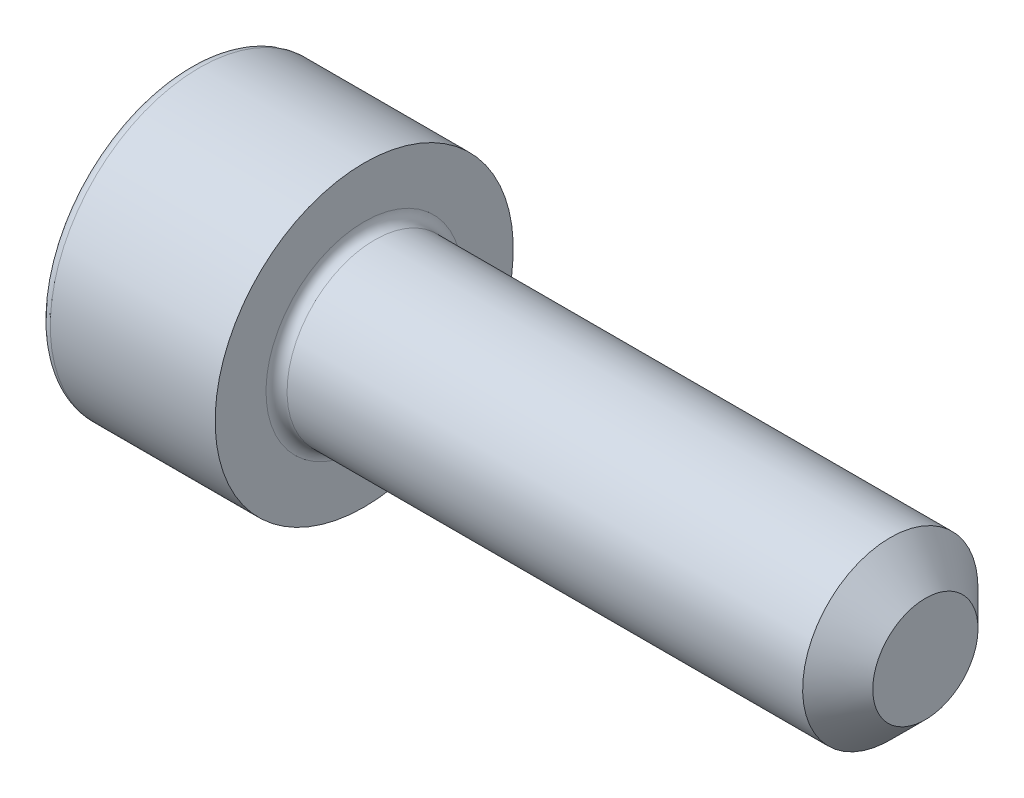
ISO-10303-21;
HEADER;
FILE_DESCRIPTION(('STEP AP214'),'2;1');
FILE_NAME('part.step','',(''),(''),'','','');
FILE_SCHEMA(('AUTOMOTIVE_DESIGN { 1 0 10303 214 1 1 1 1 }'));
ENDSEC;
DATA;
#1=APPLICATION_CONTEXT('core data for automotive mechanical design processes');
#2=APPLICATION_PROTOCOL_DEFINITION('international standard','automotive_design',2000,#1);
#3=PRODUCT_CONTEXT('',#1,'mechanical');
#4=PRODUCT('Part','Part','',(#3));
#5=PRODUCT_RELATED_PRODUCT_CATEGORY('part','',(#4));
#6=PRODUCT_DEFINITION_FORMATION('','',#4);
#7=PRODUCT_DEFINITION_CONTEXT('part definition',#1,'design');
#8=PRODUCT_DEFINITION('design','',#6,#7);
#9=PRODUCT_DEFINITION_SHAPE('','',#8);
#10=(LENGTH_UNIT() NAMED_UNIT(*) SI_UNIT(.MILLI.,.METRE.));
#11=(NAMED_UNIT(*) PLANE_ANGLE_UNIT() SI_UNIT($,.RADIAN.));
#12=(NAMED_UNIT(*) SI_UNIT($,.STERADIAN.) SOLID_ANGLE_UNIT());
#13=UNCERTAINTY_MEASURE_WITH_UNIT(LENGTH_MEASURE(1.E-05),#10,'distance_accuracy_value','');
#14=(GEOMETRIC_REPRESENTATION_CONTEXT(3) GLOBAL_UNCERTAINTY_ASSIGNED_CONTEXT((#13)) GLOBAL_UNIT_ASSIGNED_CONTEXT((#10,
#11,#12)) REPRESENTATION_CONTEXT('',''));
#15=CARTESIAN_POINT('',(0.,0.,0.));
#16=DIRECTION('',(0.,0.,1.));
#17=DIRECTION('',(1.,0.,0.));
#18=AXIS2_PLACEMENT_3D('',#15,#16,#17);
#19=CARTESIAN_POINT('',(0.,0.,0.));
#20=DIRECTION('',(-1.,0.,0.));
#21=DIRECTION('',(0.,-1.,0.));
#22=AXIS2_PLACEMENT_3D('',#19,#20,#21);
#23=PLANE('',#22);
#24=CARTESIAN_POINT('',(0.,0.,0.));
#25=DIRECTION('',(-1.,0.,0.));
#26=DIRECTION('',(0.,-1.,0.));
#27=AXIS2_PLACEMENT_3D('',#24,#25,#26);
#28=CIRCLE('',#27,3.95);
#29=CARTESIAN_POINT('',(0.,-3.95,0.));
#30=VERTEX_POINT('',#29);
#31=EDGE_CURVE('E158',#30,#30,#28,.T.);
#32=ORIENTED_EDGE('',*,*,#31,.T.);
#33=EDGE_LOOP('',(#32));
#34=FACE_BOUND('',#33,.T.);
#35=DIRECTION('',(0.,0.,-1.));
#36=VECTOR('',#35,1.);
#37=CARTESIAN_POINT('',(0.,2.,1.15470053837925));
#38=LINE('',#37,#36);
#39=CARTESIAN_POINT('',(0.,2.,1.15470053837925));
#40=VERTEX_POINT('',#39);
#41=CARTESIAN_POINT('',(0.,2.,-1.15470053837925));
#42=VERTEX_POINT('',#41);
#43=EDGE_CURVE('E54',#40,#42,#38,.T.);
#44=ORIENTED_EDGE('',*,*,#43,.F.);
#45=DIRECTION('',(0.,0.866025403784439,-0.5));
#46=VECTOR('',#45,1.);
#47=CARTESIAN_POINT('',(0.,0.,2.3094010767585));
#48=LINE('',#47,#46);
#49=CARTESIAN_POINT('',(0.,0.,2.3094010767585));
#50=VERTEX_POINT('',#49);
#51=EDGE_CURVE('E137',#50,#40,#48,.T.);
#52=ORIENTED_EDGE('',*,*,#51,.F.);
#53=DIRECTION('',(0.,0.866025403784438,0.5));
#54=VECTOR('',#53,1.);
#55=CARTESIAN_POINT('',(0.,-2.,1.15470053837925));
#56=LINE('',#55,#54);
#57=CARTESIAN_POINT('',(0.,-2.,1.15470053837925));
#58=VERTEX_POINT('',#57);
#59=EDGE_CURVE('E135',#58,#50,#56,.T.);
#60=ORIENTED_EDGE('',*,*,#59,.F.);
#61=DIRECTION('',(0.,0.,1.));
#62=VECTOR('',#61,1.);
#63=CARTESIAN_POINT('',(0.,-2.,-1.15470053837925));
#64=LINE('',#63,#62);
#65=CARTESIAN_POINT('',(0.,-2.,-1.15470053837925));
#66=VERTEX_POINT('',#65);
#67=EDGE_CURVE('E102',#66,#58,#64,.T.);
#68=ORIENTED_EDGE('',*,*,#67,.F.);
#69=DIRECTION('',(0.,-0.866025403784439,0.5));
#70=VECTOR('',#69,1.);
#71=CARTESIAN_POINT('',(0.,0.,-2.3094010767585));
#72=LINE('',#71,#70);
#73=CARTESIAN_POINT('',(0.,0.,-2.3094010767585));
#74=VERTEX_POINT('',#73);
#75=EDGE_CURVE('E131',#74,#66,#72,.T.);
#76=ORIENTED_EDGE('',*,*,#75,.F.);
#77=DIRECTION('',(0.,-0.866025403784439,-0.5));
#78=VECTOR('',#77,1.);
#79=CARTESIAN_POINT('',(0.,2.,-1.15470053837925));
#80=LINE('',#79,#78);
#81=EDGE_CURVE('E128',#42,#74,#80,.T.);
#82=ORIENTED_EDGE('',*,*,#81,.F.);
#83=EDGE_LOOP('',(#44,#52,#60,#68,#76,#82));
#84=FACE_BOUND('',#83,.T.);
#85=ADVANCED_FACE('F38',(#34,#84),#23,.T.);
#86=CARTESIAN_POINT('',(21.,0.,0.));
#87=DIRECTION('',(1.,0.,0.));
#88=DIRECTION('',(0.,1.,0.));
#89=AXIS2_PLACEMENT_3D('',#86,#87,#88);
#90=CYLINDRICAL_SURFACE('',#89,4.25);
#91=CARTESIAN_POINT('',(0.300000000000002,0.,0.));
#92=DIRECTION('',(-1.,0.,0.));
#93=DIRECTION('',(0.,-1.,0.));
#94=AXIS2_PLACEMENT_3D('',#91,#92,#93);
#95=CIRCLE('',#94,4.25);
#96=CARTESIAN_POINT('',(0.300000000000002,-4.25,0.));
#97=VERTEX_POINT('',#96);
#98=EDGE_CURVE('E155',#97,#97,#95,.F.);
#99=ORIENTED_EDGE('',*,*,#98,.T.);
#100=EDGE_LOOP('',(#99));
#101=FACE_BOUND('',#100,.T.);
#102=CARTESIAN_POINT('',(5.,0.,0.));
#103=DIRECTION('',(1.,0.,0.));
#104=DIRECTION('',(0.,1.,0.));
#105=AXIS2_PLACEMENT_3D('',#102,#103,#104);
#106=CIRCLE('',#105,4.25);
#107=CARTESIAN_POINT('',(5.,4.25,0.));
#108=VERTEX_POINT('',#107);
#109=EDGE_CURVE('E141',#108,#108,#106,.T.);
#110=ORIENTED_EDGE('',*,*,#109,.F.);
#111=EDGE_LOOP('',(#110));
#112=FACE_BOUND('',#111,.T.);
#113=ADVANCED_FACE('F175',(#101,#112),#90,.T.);
#114=CARTESIAN_POINT('',(5.,4.25,0.));
#115=DIRECTION('',(1.,0.,0.));
#116=DIRECTION('',(0.,1.,0.));
#117=AXIS2_PLACEMENT_3D('',#114,#115,#116);
#118=PLANE('',#117);
#119=CARTESIAN_POINT('',(5.,0.,0.));
#120=DIRECTION('',(1.,0.,0.));
#121=DIRECTION('',(0.,1.,0.));
#122=AXIS2_PLACEMENT_3D('',#119,#120,#121);
#123=CIRCLE('',#122,2.8);
#124=CARTESIAN_POINT('',(5.,2.8,0.));
#125=VERTEX_POINT('',#124);
#126=EDGE_CURVE('E152',#125,#125,#123,.F.);
#127=ORIENTED_EDGE('',*,*,#126,.T.);
#128=EDGE_LOOP('',(#127));
#129=FACE_BOUND('',#128,.T.);
#130=ORIENTED_EDGE('',*,*,#109,.T.);
#131=EDGE_LOOP('',(#130));
#132=FACE_BOUND('',#131,.T.);
#133=ADVANCED_FACE('F181',(#129,#132),#118,.T.);
#134=CARTESIAN_POINT('',(21.,0.,0.));
#135=DIRECTION('',(1.,0.,0.));
#136=DIRECTION('',(0.,1.,0.));
#137=AXIS2_PLACEMENT_3D('',#134,#135,#136);
#138=CYLINDRICAL_SURFACE('',#137,2.5);
#139=CARTESIAN_POINT('',(20.,0.,0.));
#140=DIRECTION('',(1.,0.,0.));
#141=DIRECTION('',(0.,1.,0.));
#142=AXIS2_PLACEMENT_3D('',#139,#140,#141);
#143=CIRCLE('',#142,2.5);
#144=CARTESIAN_POINT('',(20.,2.5,0.));
#145=VERTEX_POINT('',#144);
#146=EDGE_CURVE('E11',#145,#145,#143,.F.);
#147=ORIENTED_EDGE('',*,*,#146,.T.);
#148=EDGE_LOOP('',(#147));
#149=FACE_BOUND('',#148,.T.);
#150=CARTESIAN_POINT('',(5.3,0.,0.));
#151=DIRECTION('',(1.,0.,0.));
#152=DIRECTION('',(0.,1.,0.));
#153=AXIS2_PLACEMENT_3D('',#150,#151,#152);
#154=CIRCLE('',#153,2.5);
#155=CARTESIAN_POINT('',(5.3,2.5,0.));
#156=VERTEX_POINT('',#155);
#157=EDGE_CURVE('E149',#156,#156,#154,.T.);
#158=ORIENTED_EDGE('',*,*,#157,.T.);
#159=EDGE_LOOP('',(#158));
#160=FACE_BOUND('',#159,.T.);
#161=ADVANCED_FACE('F198',(#149,#160),#138,.T.);
#162=CARTESIAN_POINT('',(21.,2.5,0.));
#163=DIRECTION('',(1.,0.,0.));
#164=DIRECTION('',(0.,1.,0.));
#165=AXIS2_PLACEMENT_3D('',#162,#163,#164);
#166=PLANE('',#165);
#167=CARTESIAN_POINT('',(21.,0.,0.));
#168=DIRECTION('',(1.,0.,0.));
#169=DIRECTION('',(0.,1.,0.));
#170=AXIS2_PLACEMENT_3D('',#167,#168,#169);
#171=CIRCLE('',#170,1.5);
#172=CARTESIAN_POINT('',(21.,1.5,0.));
#173=VERTEX_POINT('',#172);
#174=EDGE_CURVE('E47',#173,#173,#171,.T.);
#175=ORIENTED_EDGE('',*,*,#174,.T.);
#176=EDGE_LOOP('',(#175));
#177=FACE_BOUND('',#176,.T.);
#178=ADVANCED_FACE('F163',(#177),#166,.T.);
#179=CARTESIAN_POINT('',(2.5,2.,1.15470053837925));
#180=DIRECTION('',(0.,1.,0.));
#181=DIRECTION('',(-1.,0.,0.));
#182=AXIS2_PLACEMENT_3D('',#179,#180,#181);
#183=PLANE('',#182);
#184=ORIENTED_EDGE('',*,*,#43,.T.);
#185=DIRECTION('',(-1.,0.,0.));
#186=VECTOR('',#185,1.);
#187=CARTESIAN_POINT('',(2.5,2.,-1.15470053837925));
#188=LINE('',#187,#186);
#189=CARTESIAN_POINT('',(2.5,2.,-1.15470053837925));
#190=VERTEX_POINT('',#189);
#191=EDGE_CURVE('E84',#190,#42,#188,.T.);
#192=ORIENTED_EDGE('',*,*,#191,.F.);
#193=DIRECTION('',(0.,0.,-1.));
#194=VECTOR('',#193,1.);
#195=CARTESIAN_POINT('',(2.5,2.,1.15470053837925));
#196=LINE('',#195,#194);
#197=CARTESIAN_POINT('',(2.5,2.,1.15470053837925));
#198=VERTEX_POINT('',#197);
#199=EDGE_CURVE('E139',#198,#190,#196,.T.);
#200=ORIENTED_EDGE('',*,*,#199,.F.);
#201=DIRECTION('',(-1.,0.,0.));
#202=VECTOR('',#201,1.);
#203=CARTESIAN_POINT('',(2.5,2.,1.15470053837925));
#204=LINE('',#203,#202);
#205=EDGE_CURVE('E62',#198,#40,#204,.T.);
#206=ORIENTED_EDGE('',*,*,#205,.T.);
#207=EDGE_LOOP('',(#184,#192,#200,#206));
#208=FACE_BOUND('',#207,.T.);
#209=ADVANCED_FACE('F206',(#208),#183,.F.);
#210=CARTESIAN_POINT('',(2.5,0.,2.3094010767585));
#211=DIRECTION('',(0.,0.5,0.866025403784439));
#212=DIRECTION('',(0.,-0.866025403784439,0.5));
#213=AXIS2_PLACEMENT_3D('',#210,#211,#212);
#214=PLANE('',#213);
#215=ORIENTED_EDGE('',*,*,#51,.T.);
#216=ORIENTED_EDGE('',*,*,#205,.F.);
#217=DIRECTION('',(0.,0.866025403784439,-0.5));
#218=VECTOR('',#217,1.);
#219=CARTESIAN_POINT('',(2.5,0.,2.3094010767585));
#220=LINE('',#219,#218);
#221=CARTESIAN_POINT('',(2.5,0.,2.3094010767585));
#222=VERTEX_POINT('',#221);
#223=EDGE_CURVE('E114',#222,#198,#220,.T.);
#224=ORIENTED_EDGE('',*,*,#223,.F.);
#225=DIRECTION('',(-1.,0.,0.));
#226=VECTOR('',#225,1.);
#227=CARTESIAN_POINT('',(2.5,0.,2.3094010767585));
#228=LINE('',#227,#226);
#229=EDGE_CURVE('E106',#222,#50,#228,.T.);
#230=ORIENTED_EDGE('',*,*,#229,.T.);
#231=EDGE_LOOP('',(#215,#216,#224,#230));
#232=FACE_BOUND('',#231,.T.);
#233=ADVANCED_FACE('F212',(#232),#214,.F.);
#234=CARTESIAN_POINT('',(2.5,-2.,1.15470053837925));
#235=DIRECTION('',(0.,-0.5,0.866025403784438));
#236=DIRECTION('',(0.,-0.866025403784439,-0.5));
#237=AXIS2_PLACEMENT_3D('',#234,#235,#236);
#238=PLANE('',#237);
#239=ORIENTED_EDGE('',*,*,#59,.T.);
#240=ORIENTED_EDGE('',*,*,#229,.F.);
#241=DIRECTION('',(0.,0.866025403784438,0.5));
#242=VECTOR('',#241,1.);
#243=CARTESIAN_POINT('',(2.5,-2.,1.15470053837925));
#244=LINE('',#243,#242);
#245=CARTESIAN_POINT('',(2.5,-2.,1.15470053837925));
#246=VERTEX_POINT('',#245);
#247=EDGE_CURVE('E110',#246,#222,#244,.T.);
#248=ORIENTED_EDGE('',*,*,#247,.F.);
#249=DIRECTION('',(-1.,0.,0.));
#250=VECTOR('',#249,1.);
#251=CARTESIAN_POINT('',(2.5,-2.,1.15470053837925));
#252=LINE('',#251,#250);
#253=EDGE_CURVE('E95',#246,#58,#252,.T.);
#254=ORIENTED_EDGE('',*,*,#253,.T.);
#255=EDGE_LOOP('',(#239,#240,#248,#254));
#256=FACE_BOUND('',#255,.T.);
#257=ADVANCED_FACE('F111',(#256),#238,.F.);
#258=CARTESIAN_POINT('',(2.5,-2.,-1.15470053837925));
#259=DIRECTION('',(0.,-1.,0.));
#260=DIRECTION('',(0.,0.,-1.));
#261=AXIS2_PLACEMENT_3D('',#258,#259,#260);
#262=PLANE('',#261);
#263=ORIENTED_EDGE('',*,*,#67,.T.);
#264=ORIENTED_EDGE('',*,*,#253,.F.);
#265=DIRECTION('',(0.,0.,1.));
#266=VECTOR('',#265,1.);
#267=CARTESIAN_POINT('',(2.5,-2.,-1.15470053837925));
#268=LINE('',#267,#266);
#269=CARTESIAN_POINT('',(2.5,-2.,-1.15470053837925));
#270=VERTEX_POINT('',#269);
#271=EDGE_CURVE('E99',#270,#246,#268,.T.);
#272=ORIENTED_EDGE('',*,*,#271,.F.);
#273=DIRECTION('',(-1.,0.,0.));
#274=VECTOR('',#273,1.);
#275=CARTESIAN_POINT('',(2.5,-2.,-1.15470053837925));
#276=LINE('',#275,#274);
#277=EDGE_CURVE('E107',#270,#66,#276,.T.);
#278=ORIENTED_EDGE('',*,*,#277,.T.);
#279=EDGE_LOOP('',(#263,#264,#272,#278));
#280=FACE_BOUND('',#279,.T.);
#281=ADVANCED_FACE('F97',(#280),#262,.F.);
#282=CARTESIAN_POINT('',(2.5,0.,-2.3094010767585));
#283=DIRECTION('',(0.,-0.5,-0.866025403784439));
#284=DIRECTION('',(0.,0.866025403784439,-0.5));
#285=AXIS2_PLACEMENT_3D('',#282,#283,#284);
#286=PLANE('',#285);
#287=ORIENTED_EDGE('',*,*,#75,.T.);
#288=ORIENTED_EDGE('',*,*,#277,.F.);
#289=DIRECTION('',(0.,-0.866025403784439,0.5));
#290=VECTOR('',#289,1.);
#291=CARTESIAN_POINT('',(2.5,0.,-2.3094010767585));
#292=LINE('',#291,#290);
#293=CARTESIAN_POINT('',(2.5,0.,-2.3094010767585));
#294=VERTEX_POINT('',#293);
#295=EDGE_CURVE('E120',#294,#270,#292,.T.);
#296=ORIENTED_EDGE('',*,*,#295,.F.);
#297=DIRECTION('',(-1.,0.,0.));
#298=VECTOR('',#297,1.);
#299=CARTESIAN_POINT('',(2.5,0.,-2.3094010767585));
#300=LINE('',#299,#298);
#301=EDGE_CURVE('E144',#294,#74,#300,.T.);
#302=ORIENTED_EDGE('',*,*,#301,.T.);
#303=EDGE_LOOP('',(#287,#288,#296,#302));
#304=FACE_BOUND('',#303,.T.);
#305=ADVANCED_FACE('F215',(#304),#286,.F.);
#306=CARTESIAN_POINT('',(2.5,2.,-1.15470053837925));
#307=DIRECTION('',(0.,0.5,-0.866025403784439));
#308=DIRECTION('',(0.,0.866025403784439,0.5));
#309=AXIS2_PLACEMENT_3D('',#306,#307,#308);
#310=PLANE('',#309);
#311=ORIENTED_EDGE('',*,*,#81,.T.);
#312=ORIENTED_EDGE('',*,*,#301,.F.);
#313=DIRECTION('',(0.,-0.866025403784439,-0.5));
#314=VECTOR('',#313,1.);
#315=CARTESIAN_POINT('',(2.5,2.,-1.15470053837925));
#316=LINE('',#315,#314);
#317=EDGE_CURVE('E122',#190,#294,#316,.T.);
#318=ORIENTED_EDGE('',*,*,#317,.F.);
#319=ORIENTED_EDGE('',*,*,#191,.T.);
#320=EDGE_LOOP('',(#311,#312,#318,#319));
#321=FACE_BOUND('',#320,.T.);
#322=ADVANCED_FACE('F192',(#321),#310,.F.);
#323=CARTESIAN_POINT('',(2.5,0.,0.));
#324=DIRECTION('',(-1.,0.,0.));
#325=DIRECTION('',(0.,-1.,0.));
#326=AXIS2_PLACEMENT_3D('',#323,#324,#325);
#327=PLANE('',#326);
#328=ORIENTED_EDGE('',*,*,#199,.T.);
#329=ORIENTED_EDGE('',*,*,#317,.T.);
#330=ORIENTED_EDGE('',*,*,#295,.T.);
#331=ORIENTED_EDGE('',*,*,#271,.T.);
#332=ORIENTED_EDGE('',*,*,#247,.T.);
#333=ORIENTED_EDGE('',*,*,#223,.T.);
#334=EDGE_LOOP('',(#328,#329,#330,#331,#332,#333));
#335=FACE_BOUND('',#334,.T.);
#336=ADVANCED_FACE('F117',(#335),#327,.T.);
#337=CARTESIAN_POINT('',(5.3,0.,0.));
#338=DIRECTION('',(1.,0.,0.));
#339=DIRECTION('',(0.,1.,0.));
#340=AXIS2_PLACEMENT_3D('',#337,#338,#339);
#341=TOROIDAL_SURFACE('',#340,2.8,0.3);
#342=ORIENTED_EDGE('',*,*,#126,.F.);
#343=EDGE_LOOP('',(#342));
#344=FACE_BOUND('',#343,.T.);
#345=ORIENTED_EDGE('',*,*,#157,.F.);
#346=EDGE_LOOP('',(#345));
#347=FACE_BOUND('',#346,.T.);
#348=ADVANCED_FACE('F171',(#344,#347),#341,.F.);
#349=CARTESIAN_POINT('',(0.300000000000002,0.,0.));
#350=DIRECTION('',(-1.,0.,0.));
#351=DIRECTION('',(0.,-1.,0.));
#352=AXIS2_PLACEMENT_3D('',#349,#350,#351);
#353=TOROIDAL_SURFACE('',#352,3.95,0.3);
#354=ORIENTED_EDGE('',*,*,#31,.F.);
#355=EDGE_LOOP('',(#354));
#356=FACE_BOUND('',#355,.T.);
#357=ORIENTED_EDGE('',*,*,#98,.F.);
#358=EDGE_LOOP('',(#357));
#359=FACE_BOUND('',#358,.T.);
#360=ADVANCED_FACE('F166',(#356,#359),#353,.T.);
#361=CARTESIAN_POINT('',(21.,0.,0.));
#362=DIRECTION('',(-1.,0.,0.));
#363=DIRECTION('',(0.,-1.,0.));
#364=AXIS2_PLACEMENT_3D('',#361,#362,#363);
#365=CONICAL_SURFACE('',#364,1.5,0.785398163397446);
#366=ORIENTED_EDGE('',*,*,#146,.F.);
#367=EDGE_LOOP('',(#366));
#368=FACE_BOUND('',#367,.T.);
#369=ORIENTED_EDGE('',*,*,#174,.F.);
#370=EDGE_LOOP('',(#369));
#371=FACE_BOUND('',#370,.T.);
#372=ADVANCED_FACE('F41',(#368,#371),#365,.T.);
#373=CLOSED_SHELL('',(#85,#113,#133,#161,#178,#209,#233,#257,#281,#305,#322,#336,#348,#360,#372));
#374=MANIFOLD_SOLID_BREP('B2',#373);
#375=ADVANCED_BREP_SHAPE_REPRESENTATION('',(#18,#374),#14);
#376=SHAPE_DEFINITION_REPRESENTATION(#9,#375);
ENDSEC;
END-ISO-10303-21;
